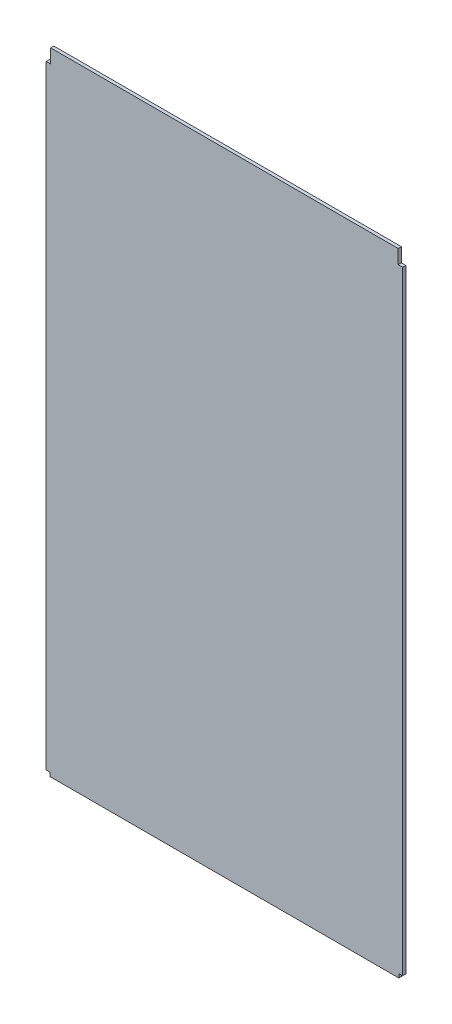
ISO-10303-21;
HEADER;
FILE_DESCRIPTION(('STEP AP214'),'2;1');
FILE_NAME('part.step','',(''),(''),'','','');
FILE_SCHEMA(('AUTOMOTIVE_DESIGN { 1 0 10303 214 1 1 1 1 }'));
ENDSEC;
DATA;
#1=APPLICATION_CONTEXT('core data for automotive mechanical design processes');
#2=APPLICATION_PROTOCOL_DEFINITION('international standard','automotive_design',2000,#1);
#3=PRODUCT_CONTEXT('',#1,'mechanical');
#4=PRODUCT('Part','Part','',(#3));
#5=PRODUCT_RELATED_PRODUCT_CATEGORY('part','',(#4));
#6=PRODUCT_DEFINITION_FORMATION('','',#4);
#7=PRODUCT_DEFINITION_CONTEXT('part definition',#1,'design');
#8=PRODUCT_DEFINITION('design','',#6,#7);
#9=PRODUCT_DEFINITION_SHAPE('','',#8);
#10=(LENGTH_UNIT() NAMED_UNIT(*) SI_UNIT(.MILLI.,.METRE.));
#11=(NAMED_UNIT(*) PLANE_ANGLE_UNIT() SI_UNIT($,.RADIAN.));
#12=(NAMED_UNIT(*) SI_UNIT($,.STERADIAN.) SOLID_ANGLE_UNIT());
#13=UNCERTAINTY_MEASURE_WITH_UNIT(LENGTH_MEASURE(1.E-05),#10,'distance_accuracy_value','');
#14=(GEOMETRIC_REPRESENTATION_CONTEXT(3) GLOBAL_UNCERTAINTY_ASSIGNED_CONTEXT((#13)) GLOBAL_UNIT_ASSIGNED_CONTEXT((#10,
#11,#12)) REPRESENTATION_CONTEXT('',''));
#15=CARTESIAN_POINT('',(0.,0.,0.));
#16=DIRECTION('',(0.,0.,1.));
#17=DIRECTION('',(1.,0.,0.));
#18=AXIS2_PLACEMENT_3D('',#15,#16,#17);
#19=CARTESIAN_POINT('',(27.,1000.,0.));
#20=DIRECTION('',(-1.,0.,0.));
#21=DIRECTION('',(0.,-1.,0.));
#22=AXIS2_PLACEMENT_3D('',#19,#20,#21);
#23=PLANE('',#22);
#24=DIRECTION('',(0.,-1.,0.));
#25=VECTOR('',#24,1.);
#26=CARTESIAN_POINT('',(27.,1000.,0.));
#27=LINE('',#26,#25);
#28=CARTESIAN_POINT('',(27.,992.,0.));
#29=VERTEX_POINT('',#28);
#30=CARTESIAN_POINT('',(27.,970.,0.));
#31=VERTEX_POINT('',#30);
#32=EDGE_CURVE('E11',#29,#31,#27,.T.);
#33=ORIENTED_EDGE('',*,*,#32,.T.);
#34=DIRECTION('',(0.,0.,1.));
#35=VECTOR('',#34,1.);
#36=CARTESIAN_POINT('',(27.,970.,0.));
#37=LINE('',#36,#35);
#38=CARTESIAN_POINT('',(27.,970.,5.));
#39=VERTEX_POINT('',#38);
#40=EDGE_CURVE('E24',#31,#39,#37,.T.);
#41=ORIENTED_EDGE('',*,*,#40,.T.);
#42=DIRECTION('',(0.,-1.,0.));
#43=VECTOR('',#42,1.);
#44=CARTESIAN_POINT('',(27.,1000.,5.));
#45=LINE('',#44,#43);
#46=CARTESIAN_POINT('',(27.,992.,5.));
#47=VERTEX_POINT('',#46);
#48=EDGE_CURVE('E240',#47,#39,#45,.T.);
#49=ORIENTED_EDGE('',*,*,#48,.F.);
#50=DIRECTION('',(0.,0.,1.));
#51=VECTOR('',#50,1.);
#52=CARTESIAN_POINT('',(27.,992.,0.));
#53=LINE('',#52,#51);
#54=EDGE_CURVE('E125',#29,#47,#53,.T.);
#55=ORIENTED_EDGE('',*,*,#54,.F.);
#56=EDGE_LOOP('',(#33,#41,#49,#55));
#57=FACE_BOUND('',#56,.T.);
#58=ADVANCED_FACE('F16',(#57),#23,.T.);
#59=CARTESIAN_POINT('',(580.,970.,0.));
#60=DIRECTION('',(0.,1.,0.));
#61=DIRECTION('',(-1.,0.,0.));
#62=AXIS2_PLACEMENT_3D('',#59,#60,#61);
#63=PLANE('',#62);
#64=DIRECTION('',(-1.,0.,0.));
#65=VECTOR('',#64,1.);
#66=CARTESIAN_POINT('',(580.,970.,0.));
#67=LINE('',#66,#65);
#68=CARTESIAN_POINT('',(20.,970.,0.));
#69=VERTEX_POINT('',#68);
#70=EDGE_CURVE('E237',#31,#69,#67,.T.);
#71=ORIENTED_EDGE('',*,*,#70,.T.);
#72=DIRECTION('',(0.,0.,1.));
#73=VECTOR('',#72,1.);
#74=CARTESIAN_POINT('',(20.,970.,0.));
#75=LINE('',#74,#73);
#76=CARTESIAN_POINT('',(20.,970.,5.));
#77=VERTEX_POINT('',#76);
#78=EDGE_CURVE('E235',#69,#77,#75,.T.);
#79=ORIENTED_EDGE('',*,*,#78,.T.);
#80=DIRECTION('',(-1.,0.,0.));
#81=VECTOR('',#80,1.);
#82=CARTESIAN_POINT('',(300.,970.,5.));
#83=LINE('',#82,#81);
#84=EDGE_CURVE('E232',#39,#77,#83,.T.);
#85=ORIENTED_EDGE('',*,*,#84,.F.);
#86=ORIENTED_EDGE('',*,*,#40,.F.);
#87=EDGE_LOOP('',(#71,#79,#85,#86));
#88=FACE_BOUND('',#87,.T.);
#89=ADVANCED_FACE('F252',(#88),#63,.T.);
#90=CARTESIAN_POINT('',(20.,970.,0.));
#91=DIRECTION('',(-1.,0.,0.));
#92=DIRECTION('',(0.,-1.,0.));
#93=AXIS2_PLACEMENT_3D('',#90,#91,#92);
#94=PLANE('',#93);
#95=DIRECTION('',(0.,-1.,0.));
#96=VECTOR('',#95,1.);
#97=CARTESIAN_POINT('',(20.,1000.,0.));
#98=LINE('',#97,#96);
#99=CARTESIAN_POINT('',(20.,6.00000000000009,0.));
#100=VERTEX_POINT('',#99);
#101=EDGE_CURVE('E230',#69,#100,#98,.T.);
#102=ORIENTED_EDGE('',*,*,#101,.T.);
#103=DIRECTION('',(0.,0.,1.));
#104=VECTOR('',#103,1.);
#105=CARTESIAN_POINT('',(20.,6.00000008940704,0.));
#106=LINE('',#105,#104);
#107=CARTESIAN_POINT('',(20.,6.,5.));
#108=VERTEX_POINT('',#107);
#109=EDGE_CURVE('E228',#100,#108,#106,.T.);
#110=ORIENTED_EDGE('',*,*,#109,.T.);
#111=DIRECTION('',(0.,-1.,0.));
#112=VECTOR('',#111,1.);
#113=CARTESIAN_POINT('',(20.,1000.,5.));
#114=LINE('',#113,#112);
#115=EDGE_CURVE('E225',#77,#108,#114,.T.);
#116=ORIENTED_EDGE('',*,*,#115,.F.);
#117=ORIENTED_EDGE('',*,*,#78,.F.);
#118=EDGE_LOOP('',(#102,#110,#116,#117));
#119=FACE_BOUND('',#118,.T.);
#120=ADVANCED_FACE('F255',(#119),#94,.T.);
#121=CARTESIAN_POINT('',(574.,6.00000008940705,0.));
#122=DIRECTION('',(0.,-1.,0.));
#123=DIRECTION('',(1.,0.,0.));
#124=AXIS2_PLACEMENT_3D('',#121,#122,#123);
#125=PLANE('',#124);
#126=DIRECTION('',(-1.,0.,0.));
#127=VECTOR('',#126,1.);
#128=CARTESIAN_POINT('',(300.,6.00000008940704,0.));
#129=LINE('',#128,#127);
#130=CARTESIAN_POINT('',(26.,6.00000000000008,0.));
#131=VERTEX_POINT('',#130);
#132=EDGE_CURVE('E222',#131,#100,#129,.T.);
#133=ORIENTED_EDGE('',*,*,#132,.F.);
#134=DIRECTION('',(0.,0.,1.));
#135=VECTOR('',#134,1.);
#136=CARTESIAN_POINT('',(26.,6.00000008940705,0.));
#137=LINE('',#136,#135);
#138=CARTESIAN_POINT('',(26.,6.,5.));
#139=VERTEX_POINT('',#138);
#140=EDGE_CURVE('E220',#131,#139,#137,.T.);
#141=ORIENTED_EDGE('',*,*,#140,.T.);
#142=DIRECTION('',(1.,0.,0.));
#143=VECTOR('',#142,1.);
#144=CARTESIAN_POINT('',(300.,6.00000008940704,5.));
#145=LINE('',#144,#143);
#146=EDGE_CURVE('E215',#108,#139,#145,.T.);
#147=ORIENTED_EDGE('',*,*,#146,.F.);
#148=ORIENTED_EDGE('',*,*,#109,.F.);
#149=EDGE_LOOP('',(#133,#141,#147,#148));
#150=FACE_BOUND('',#149,.T.);
#151=ADVANCED_FACE('F260',(#150),#125,.T.);
#152=CARTESIAN_POINT('',(26.,6.00000000000008,0.));
#153=DIRECTION('',(-1.,0.,0.));
#154=DIRECTION('',(0.,-1.,0.));
#155=AXIS2_PLACEMENT_3D('',#152,#153,#154);
#156=PLANE('',#155);
#157=DIRECTION('',(0.,1.,0.));
#158=VECTOR('',#157,1.);
#159=CARTESIAN_POINT('',(26.,0.,0.));
#160=LINE('',#159,#158);
#161=CARTESIAN_POINT('',(26.,0.,0.));
#162=VERTEX_POINT('',#161);
#163=EDGE_CURVE('E210',#162,#131,#160,.T.);
#164=ORIENTED_EDGE('',*,*,#163,.F.);
#165=DIRECTION('',(0.,0.,1.));
#166=VECTOR('',#165,1.);
#167=CARTESIAN_POINT('',(26.,0.,0.));
#168=LINE('',#167,#166);
#169=CARTESIAN_POINT('',(26.,0.,5.));
#170=VERTEX_POINT('',#169);
#171=EDGE_CURVE('E206',#162,#170,#168,.T.);
#172=ORIENTED_EDGE('',*,*,#171,.T.);
#173=DIRECTION('',(0.,-1.,0.));
#174=VECTOR('',#173,1.);
#175=CARTESIAN_POINT('',(26.,0.,5.));
#176=LINE('',#175,#174);
#177=EDGE_CURVE('E201',#139,#170,#176,.T.);
#178=ORIENTED_EDGE('',*,*,#177,.F.);
#179=ORIENTED_EDGE('',*,*,#140,.F.);
#180=EDGE_LOOP('',(#164,#172,#178,#179));
#181=FACE_BOUND('',#180,.T.);
#182=ADVANCED_FACE('F263',(#181),#156,.T.);
#183=CARTESIAN_POINT('',(26.,0.,0.));
#184=DIRECTION('',(0.,-1.,0.));
#185=DIRECTION('',(1.,0.,0.));
#186=AXIS2_PLACEMENT_3D('',#183,#184,#185);
#187=PLANE('',#186);
#188=DIRECTION('',(1.,0.,0.));
#189=VECTOR('',#188,1.);
#190=CARTESIAN_POINT('',(20.,0.,0.));
#191=LINE('',#190,#189);
#192=CARTESIAN_POINT('',(574.,0.,0.));
#193=VERTEX_POINT('',#192);
#194=EDGE_CURVE('E197',#162,#193,#191,.T.);
#195=ORIENTED_EDGE('',*,*,#194,.T.);
#196=DIRECTION('',(0.,0.,1.));
#197=VECTOR('',#196,1.);
#198=CARTESIAN_POINT('',(574.,0.,0.));
#199=LINE('',#198,#197);
#200=CARTESIAN_POINT('',(574.,0.,5.));
#201=VERTEX_POINT('',#200);
#202=EDGE_CURVE('E193',#193,#201,#199,.T.);
#203=ORIENTED_EDGE('',*,*,#202,.T.);
#204=DIRECTION('',(1.,0.,0.));
#205=VECTOR('',#204,1.);
#206=CARTESIAN_POINT('',(20.,0.,5.));
#207=LINE('',#206,#205);
#208=EDGE_CURVE('E188',#170,#201,#207,.T.);
#209=ORIENTED_EDGE('',*,*,#208,.F.);
#210=ORIENTED_EDGE('',*,*,#171,.F.);
#211=EDGE_LOOP('',(#195,#203,#209,#210));
#212=FACE_BOUND('',#211,.T.);
#213=ADVANCED_FACE('F268',(#212),#187,.T.);
#214=CARTESIAN_POINT('',(574.,0.,0.));
#215=DIRECTION('',(1.,0.,0.));
#216=DIRECTION('',(0.,1.,0.));
#217=AXIS2_PLACEMENT_3D('',#214,#215,#216);
#218=PLANE('',#217);
#219=DIRECTION('',(0.,1.,0.));
#220=VECTOR('',#219,1.);
#221=CARTESIAN_POINT('',(574.,0.,0.));
#222=LINE('',#221,#220);
#223=CARTESIAN_POINT('',(574.,6.00000008940705,0.));
#224=VERTEX_POINT('',#223);
#225=EDGE_CURVE('E184',#193,#224,#222,.T.);
#226=ORIENTED_EDGE('',*,*,#225,.T.);
#227=DIRECTION('',(0.,0.,1.));
#228=VECTOR('',#227,1.);
#229=CARTESIAN_POINT('',(574.,6.00000008940705,0.));
#230=LINE('',#229,#228);
#231=CARTESIAN_POINT('',(574.,6.00000008940705,5.));
#232=VERTEX_POINT('',#231);
#233=EDGE_CURVE('E180',#224,#232,#230,.T.);
#234=ORIENTED_EDGE('',*,*,#233,.T.);
#235=DIRECTION('',(0.,1.,0.));
#236=VECTOR('',#235,1.);
#237=CARTESIAN_POINT('',(574.,0.,5.));
#238=LINE('',#237,#236);
#239=EDGE_CURVE('E175',#201,#232,#238,.T.);
#240=ORIENTED_EDGE('',*,*,#239,.F.);
#241=ORIENTED_EDGE('',*,*,#202,.F.);
#242=EDGE_LOOP('',(#226,#234,#240,#241));
#243=FACE_BOUND('',#242,.T.);
#244=ADVANCED_FACE('F273',(#243),#218,.T.);
#245=DIRECTION('',(1.,0.,0.));
#246=VECTOR('',#245,1.);
#247=CARTESIAN_POINT('',(574.,6.00000008940705,0.));
#248=LINE('',#247,#246);
#249=CARTESIAN_POINT('',(580.,6.00000008940705,0.));
#250=VERTEX_POINT('',#249);
#251=EDGE_CURVE('E171',#224,#250,#248,.T.);
#252=ORIENTED_EDGE('',*,*,#251,.T.);
#253=DIRECTION('',(0.,0.,1.));
#254=VECTOR('',#253,1.);
#255=CARTESIAN_POINT('',(580.,6.00000008940705,0.));
#256=LINE('',#255,#254);
#257=CARTESIAN_POINT('',(580.,6.00000008940705,5.));
#258=VERTEX_POINT('',#257);
#259=EDGE_CURVE('E167',#250,#258,#256,.T.);
#260=ORIENTED_EDGE('',*,*,#259,.T.);
#261=DIRECTION('',(1.,0.,0.));
#262=VECTOR('',#261,1.);
#263=CARTESIAN_POINT('',(574.,6.00000008940705,5.));
#264=LINE('',#263,#262);
#265=EDGE_CURVE('E162',#232,#258,#264,.T.);
#266=ORIENTED_EDGE('',*,*,#265,.F.);
#267=ORIENTED_EDGE('',*,*,#233,.F.);
#268=EDGE_LOOP('',(#252,#260,#266,#267));
#269=FACE_BOUND('',#268,.T.);
#270=ADVANCED_FACE('F278',(#269),#125,.T.);
#271=CARTESIAN_POINT('',(580.,6.00000008940705,0.));
#272=DIRECTION('',(1.,0.,0.));
#273=DIRECTION('',(0.,1.,0.));
#274=AXIS2_PLACEMENT_3D('',#271,#272,#273);
#275=PLANE('',#274);
#276=DIRECTION('',(0.,1.,0.));
#277=VECTOR('',#276,1.);
#278=CARTESIAN_POINT('',(580.,0.,0.));
#279=LINE('',#278,#277);
#280=CARTESIAN_POINT('',(580.,970.,0.));
#281=VERTEX_POINT('',#280);
#282=EDGE_CURVE('E158',#250,#281,#279,.T.);
#283=ORIENTED_EDGE('',*,*,#282,.T.);
#284=DIRECTION('',(0.,0.,1.));
#285=VECTOR('',#284,1.);
#286=CARTESIAN_POINT('',(580.,970.,0.));
#287=LINE('',#286,#285);
#288=CARTESIAN_POINT('',(580.,970.,5.));
#289=VERTEX_POINT('',#288);
#290=EDGE_CURVE('E154',#281,#289,#287,.T.);
#291=ORIENTED_EDGE('',*,*,#290,.T.);
#292=DIRECTION('',(0.,1.,0.));
#293=VECTOR('',#292,1.);
#294=CARTESIAN_POINT('',(580.,0.,5.));
#295=LINE('',#294,#293);
#296=EDGE_CURVE('E150',#258,#289,#295,.T.);
#297=ORIENTED_EDGE('',*,*,#296,.F.);
#298=ORIENTED_EDGE('',*,*,#259,.F.);
#299=EDGE_LOOP('',(#283,#291,#297,#298));
#300=FACE_BOUND('',#299,.T.);
#301=ADVANCED_FACE('F283',(#300),#275,.T.);
#302=DIRECTION('',(1.,0.,0.));
#303=VECTOR('',#302,1.);
#304=CARTESIAN_POINT('',(573.,970.,0.));
#305=LINE('',#304,#303);
#306=CARTESIAN_POINT('',(573.,970.,0.));
#307=VERTEX_POINT('',#306);
#308=EDGE_CURVE('E145',#307,#281,#305,.T.);
#309=ORIENTED_EDGE('',*,*,#308,.F.);
#310=DIRECTION('',(0.,0.,1.));
#311=VECTOR('',#310,1.);
#312=CARTESIAN_POINT('',(573.,970.,0.));
#313=LINE('',#312,#311);
#314=CARTESIAN_POINT('',(573.,970.,5.));
#315=VERTEX_POINT('',#314);
#316=EDGE_CURVE('E141',#307,#315,#313,.T.);
#317=ORIENTED_EDGE('',*,*,#316,.T.);
#318=DIRECTION('',(-1.,0.,0.));
#319=VECTOR('',#318,1.);
#320=CARTESIAN_POINT('',(573.,970.,5.));
#321=LINE('',#320,#319);
#322=EDGE_CURVE('E110',#289,#315,#321,.T.);
#323=ORIENTED_EDGE('',*,*,#322,.F.);
#324=ORIENTED_EDGE('',*,*,#290,.F.);
#325=EDGE_LOOP('',(#309,#317,#323,#324));
#326=FACE_BOUND('',#325,.T.);
#327=ADVANCED_FACE('F286',(#326),#63,.T.);
#328=CARTESIAN_POINT('',(300.,500.,0.));
#329=DIRECTION('',(0.,0.,1.));
#330=DIRECTION('',(1.,0.,0.));
#331=AXIS2_PLACEMENT_3D('',#328,#329,#330);
#332=PLANE('',#331);
#333=DIRECTION('',(0.,-1.,0.));
#334=VECTOR('',#333,1.);
#335=CARTESIAN_POINT('',(573.,1000.,0.));
#336=LINE('',#335,#334);
#337=CARTESIAN_POINT('',(573.,992.,0.));
#338=VERTEX_POINT('',#337);
#339=EDGE_CURVE('E120',#338,#307,#336,.T.);
#340=ORIENTED_EDGE('',*,*,#339,.T.);
#341=ORIENTED_EDGE('',*,*,#308,.T.);
#342=ORIENTED_EDGE('',*,*,#282,.F.);
#343=ORIENTED_EDGE('',*,*,#251,.F.);
#344=ORIENTED_EDGE('',*,*,#225,.F.);
#345=ORIENTED_EDGE('',*,*,#194,.F.);
#346=ORIENTED_EDGE('',*,*,#163,.T.);
#347=ORIENTED_EDGE('',*,*,#132,.T.);
#348=ORIENTED_EDGE('',*,*,#101,.F.);
#349=ORIENTED_EDGE('',*,*,#70,.F.);
#350=ORIENTED_EDGE('',*,*,#32,.F.);
#351=DIRECTION('',(-1.,0.,0.));
#352=VECTOR('',#351,1.);
#353=CARTESIAN_POINT('',(436.5,992.,0.));
#354=LINE('',#353,#352);
#355=EDGE_CURVE('E113',#338,#29,#354,.T.);
#356=ORIENTED_EDGE('',*,*,#355,.F.);
#357=EDGE_LOOP('',(#340,#341,#342,#343,#344,#345,#346,#347,#348,#349,#350,#356));
#358=FACE_BOUND('',#357,.T.);
#359=ADVANCED_FACE('F248',(#358),#332,.F.);
#360=CARTESIAN_POINT('',(300.,500.,5.));
#361=DIRECTION('',(0.,0.,1.));
#362=DIRECTION('',(1.,0.,0.));
#363=AXIS2_PLACEMENT_3D('',#360,#361,#362);
#364=PLANE('',#363);
#365=ORIENTED_EDGE('',*,*,#48,.T.);
#366=ORIENTED_EDGE('',*,*,#84,.T.);
#367=ORIENTED_EDGE('',*,*,#115,.T.);
#368=ORIENTED_EDGE('',*,*,#146,.T.);
#369=ORIENTED_EDGE('',*,*,#177,.T.);
#370=ORIENTED_EDGE('',*,*,#208,.T.);
#371=ORIENTED_EDGE('',*,*,#239,.T.);
#372=ORIENTED_EDGE('',*,*,#265,.T.);
#373=ORIENTED_EDGE('',*,*,#296,.T.);
#374=ORIENTED_EDGE('',*,*,#322,.T.);
#375=DIRECTION('',(0.,1.,0.));
#376=VECTOR('',#375,1.);
#377=CARTESIAN_POINT('',(573.,990.,5.));
#378=LINE('',#377,#376);
#379=CARTESIAN_POINT('',(573.,992.,5.));
#380=VERTEX_POINT('',#379);
#381=EDGE_CURVE('E101',#315,#380,#378,.T.);
#382=ORIENTED_EDGE('',*,*,#381,.T.);
#383=DIRECTION('',(1.,0.,0.));
#384=VECTOR('',#383,1.);
#385=CARTESIAN_POINT('',(436.5,992.,5.));
#386=LINE('',#385,#384);
#387=EDGE_CURVE('E106',#47,#380,#386,.T.);
#388=ORIENTED_EDGE('',*,*,#387,.F.);
#389=EDGE_LOOP('',(#365,#366,#367,#368,#369,#370,#371,#372,#373,#374,#382,#388));
#390=FACE_BOUND('',#389,.T.);
#391=ADVANCED_FACE('F104',(#390),#364,.T.);
#392=CARTESIAN_POINT('',(573.,970.,0.));
#393=DIRECTION('',(1.,0.,0.));
#394=DIRECTION('',(0.,1.,0.));
#395=AXIS2_PLACEMENT_3D('',#392,#393,#394);
#396=PLANE('',#395);
#397=ORIENTED_EDGE('',*,*,#381,.F.);
#398=ORIENTED_EDGE('',*,*,#316,.F.);
#399=ORIENTED_EDGE('',*,*,#339,.F.);
#400=DIRECTION('',(0.,0.,-1.));
#401=VECTOR('',#400,1.);
#402=CARTESIAN_POINT('',(573.,992.,0.));
#403=LINE('',#402,#401);
#404=EDGE_CURVE('E117',#380,#338,#403,.T.);
#405=ORIENTED_EDGE('',*,*,#404,.F.);
#406=EDGE_LOOP('',(#397,#398,#399,#405));
#407=FACE_BOUND('',#406,.T.);
#408=ADVANCED_FACE('F118',(#407),#396,.T.);
#409=CARTESIAN_POINT('',(573.,992.,0.));
#410=DIRECTION('',(0.,1.,0.));
#411=DIRECTION('',(0.,0.,1.));
#412=AXIS2_PLACEMENT_3D('',#409,#410,#411);
#413=PLANE('',#412);
#414=ORIENTED_EDGE('',*,*,#355,.T.);
#415=ORIENTED_EDGE('',*,*,#54,.T.);
#416=ORIENTED_EDGE('',*,*,#387,.T.);
#417=ORIENTED_EDGE('',*,*,#404,.T.);
#418=EDGE_LOOP('',(#414,#415,#416,#417));
#419=FACE_BOUND('',#418,.T.);
#420=ADVANCED_FACE('F124',(#419),#413,.T.);
#421=CLOSED_SHELL('',(#58,#89,#120,#151,#182,#213,#244,#270,#301,#327,#359,#391,#408,#420));
#422=MANIFOLD_SOLID_BREP('B1',#421);
#423=ADVANCED_BREP_SHAPE_REPRESENTATION('',(#18,#422),#14);
#424=SHAPE_DEFINITION_REPRESENTATION(#9,#423);
ENDSEC;
END-ISO-10303-21;
